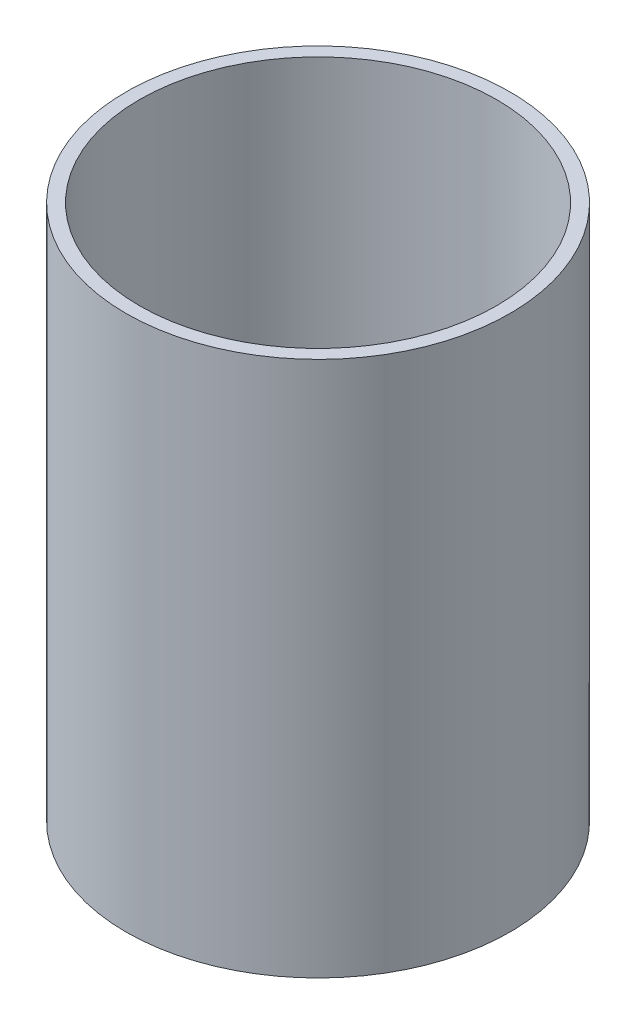
ISO-10303-21;
HEADER;
FILE_DESCRIPTION(('STEP AP214'),'2;1');
FILE_NAME('part.step','',(''),(''),'','','');
FILE_SCHEMA(('AUTOMOTIVE_DESIGN { 1 0 10303 214 1 1 1 1 }'));
ENDSEC;
DATA;
#1=APPLICATION_CONTEXT('core data for automotive mechanical design processes');
#2=APPLICATION_PROTOCOL_DEFINITION('international standard','automotive_design',2000,#1);
#3=PRODUCT_CONTEXT('',#1,'mechanical');
#4=PRODUCT('Part','Part','',(#3));
#5=PRODUCT_RELATED_PRODUCT_CATEGORY('part','',(#4));
#6=PRODUCT_DEFINITION_FORMATION('','',#4);
#7=PRODUCT_DEFINITION_CONTEXT('part definition',#1,'design');
#8=PRODUCT_DEFINITION('design','',#6,#7);
#9=PRODUCT_DEFINITION_SHAPE('','',#8);
#10=(LENGTH_UNIT() NAMED_UNIT(*) SI_UNIT(.MILLI.,.METRE.));
#11=(NAMED_UNIT(*) PLANE_ANGLE_UNIT() SI_UNIT($,.RADIAN.));
#12=(NAMED_UNIT(*) SI_UNIT($,.STERADIAN.) SOLID_ANGLE_UNIT());
#13=UNCERTAINTY_MEASURE_WITH_UNIT(LENGTH_MEASURE(1.E-05),#10,'distance_accuracy_value','');
#14=(GEOMETRIC_REPRESENTATION_CONTEXT(3) GLOBAL_UNCERTAINTY_ASSIGNED_CONTEXT((#13)) GLOBAL_UNIT_ASSIGNED_CONTEXT((#10,
#11,#12)) REPRESENTATION_CONTEXT('',''));
#15=CARTESIAN_POINT('',(0.,0.,0.));
#16=DIRECTION('',(0.,0.,1.));
#17=DIRECTION('',(1.,0.,0.));
#18=AXIS2_PLACEMENT_3D('',#15,#16,#17);
#19=CARTESIAN_POINT('',(0.,76.2,0.));
#20=DIRECTION('',(0.,1.,0.));
#21=DIRECTION('',(0.,0.,1.));
#22=AXIS2_PLACEMENT_3D('',#19,#20,#21);
#23=PLANE('',#22);
#24=CARTESIAN_POINT('',(0.,76.2,0.));
#25=DIRECTION('',(0.,1.,0.));
#26=DIRECTION('',(0.,0.,1.));
#27=AXIS2_PLACEMENT_3D('',#24,#25,#26);
#28=CIRCLE('',#27,27.305);
#29=CARTESIAN_POINT('',(0.,76.2,27.305));
#30=VERTEX_POINT('',#29);
#31=EDGE_CURVE('E10',#30,#30,#28,.T.);
#32=ORIENTED_EDGE('',*,*,#31,.T.);
#33=EDGE_LOOP('',(#32));
#34=FACE_BOUND('',#33,.T.);
#35=CARTESIAN_POINT('',(0.,76.2,0.));
#36=DIRECTION('',(0.,1.,0.));
#37=DIRECTION('',(0.,0.,1.));
#38=AXIS2_PLACEMENT_3D('',#35,#36,#37);
#39=CIRCLE('',#38,25.4);
#40=CARTESIAN_POINT('',(0.,76.2,25.4));
#41=VERTEX_POINT('',#40);
#42=EDGE_CURVE('E57',#41,#41,#39,.T.);
#43=ORIENTED_EDGE('',*,*,#42,.F.);
#44=EDGE_LOOP('',(#43));
#45=FACE_BOUND('',#44,.T.);
#46=ADVANCED_FACE('F43',(#34,#45),#23,.T.);
#47=CARTESIAN_POINT('',(0.,0.,0.));
#48=DIRECTION('',(0.,1.,0.));
#49=DIRECTION('',(0.,0.,1.));
#50=AXIS2_PLACEMENT_3D('',#47,#48,#49);
#51=PLANE('',#50);
#52=CARTESIAN_POINT('',(0.,0.,0.));
#53=DIRECTION('',(0.,1.,0.));
#54=DIRECTION('',(0.,0.,1.));
#55=AXIS2_PLACEMENT_3D('',#52,#53,#54);
#56=CIRCLE('',#55,27.305);
#57=CARTESIAN_POINT('',(0.,0.,27.305));
#58=VERTEX_POINT('',#57);
#59=EDGE_CURVE('E47',#58,#58,#56,.T.);
#60=ORIENTED_EDGE('',*,*,#59,.F.);
#61=EDGE_LOOP('',(#60));
#62=FACE_BOUND('',#61,.T.);
#63=CARTESIAN_POINT('',(0.,0.,0.));
#64=DIRECTION('',(0.,1.,0.));
#65=DIRECTION('',(0.,0.,1.));
#66=AXIS2_PLACEMENT_3D('',#63,#64,#65);
#67=CIRCLE('',#66,25.4);
#68=CARTESIAN_POINT('',(0.,0.,25.4));
#69=VERTEX_POINT('',#68);
#70=EDGE_CURVE('E59',#69,#69,#67,.T.);
#71=ORIENTED_EDGE('',*,*,#70,.T.);
#72=EDGE_LOOP('',(#71));
#73=FACE_BOUND('',#72,.T.);
#74=ADVANCED_FACE('F70',(#62,#73),#51,.F.);
#75=CARTESIAN_POINT('',(0.,76.2,0.));
#76=DIRECTION('',(0.,-1.,0.));
#77=DIRECTION('',(0.,0.,-1.));
#78=AXIS2_PLACEMENT_3D('',#75,#76,#77);
#79=CYLINDRICAL_SURFACE('',#78,27.305);
#80=ORIENTED_EDGE('',*,*,#31,.F.);
#81=EDGE_LOOP('',(#80));
#82=FACE_BOUND('',#81,.T.);
#83=ORIENTED_EDGE('',*,*,#59,.T.);
#84=EDGE_LOOP('',(#83));
#85=FACE_BOUND('',#84,.T.);
#86=ADVANCED_FACE('F45',(#82,#85),#79,.T.);
#87=CARTESIAN_POINT('',(0.,76.2,0.));
#88=DIRECTION('',(0.,-1.,0.));
#89=DIRECTION('',(0.,0.,-1.));
#90=AXIS2_PLACEMENT_3D('',#87,#88,#89);
#91=CYLINDRICAL_SURFACE('',#90,25.4);
#92=ORIENTED_EDGE('',*,*,#42,.T.);
#93=EDGE_LOOP('',(#92));
#94=FACE_BOUND('',#93,.T.);
#95=ORIENTED_EDGE('',*,*,#70,.F.);
#96=EDGE_LOOP('',(#95));
#97=FACE_BOUND('',#96,.T.);
#98=ADVANCED_FACE('F66',(#94,#97),#91,.F.);
#99=CLOSED_SHELL('',(#46,#74,#86,#98));
#100=MANIFOLD_SOLID_BREP('B2',#99);
#101=ADVANCED_BREP_SHAPE_REPRESENTATION('',(#18,#100),#14);
#102=SHAPE_DEFINITION_REPRESENTATION(#9,#101);
ENDSEC;
END-ISO-10303-21;
